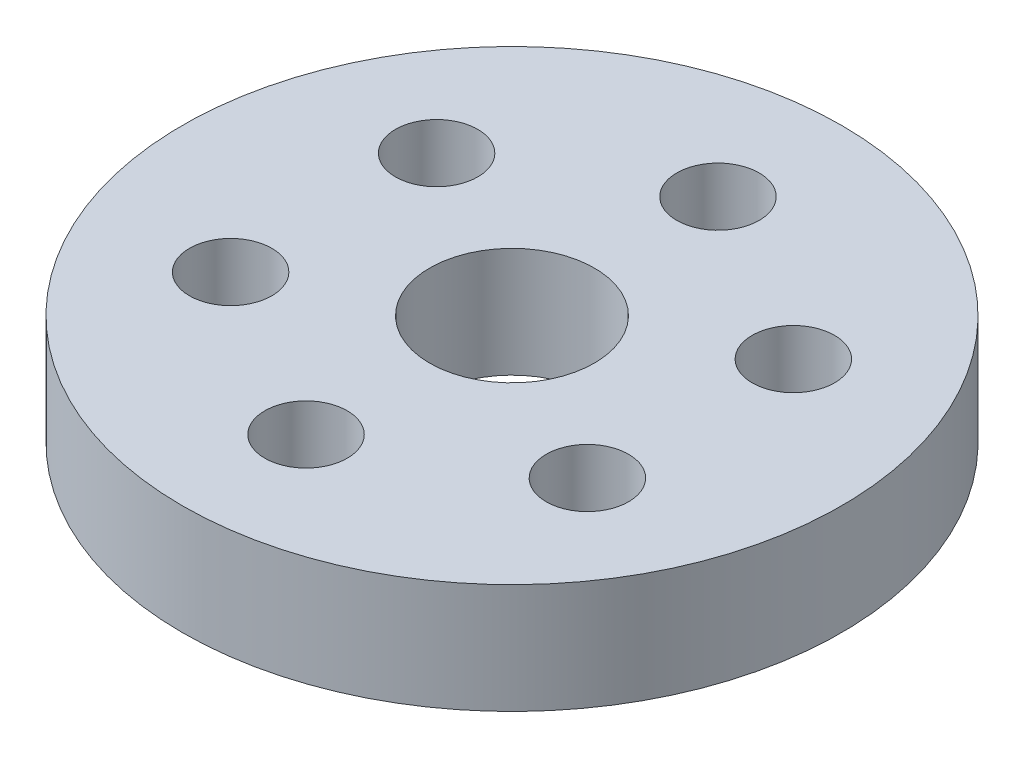
ISO-10303-21;
HEADER;
FILE_DESCRIPTION(('STEP AP214'),'2;1');
FILE_NAME('part.step','',(''),(''),'','','');
FILE_SCHEMA(('AUTOMOTIVE_DESIGN { 1 0 10303 214 1 1 1 1 }'));
ENDSEC;
DATA;
#1=APPLICATION_CONTEXT('core data for automotive mechanical design processes');
#2=APPLICATION_PROTOCOL_DEFINITION('international standard','automotive_design',2000,#1);
#3=PRODUCT_CONTEXT('',#1,'mechanical');
#4=PRODUCT('Part','Part','',(#3));
#5=PRODUCT_RELATED_PRODUCT_CATEGORY('part','',(#4));
#6=PRODUCT_DEFINITION_FORMATION('','',#4);
#7=PRODUCT_DEFINITION_CONTEXT('part definition',#1,'design');
#8=PRODUCT_DEFINITION('design','',#6,#7);
#9=PRODUCT_DEFINITION_SHAPE('','',#8);
#10=(LENGTH_UNIT() NAMED_UNIT(*) SI_UNIT(.MILLI.,.METRE.));
#11=(NAMED_UNIT(*) PLANE_ANGLE_UNIT() SI_UNIT($,.RADIAN.));
#12=(NAMED_UNIT(*) SI_UNIT($,.STERADIAN.) SOLID_ANGLE_UNIT());
#13=UNCERTAINTY_MEASURE_WITH_UNIT(LENGTH_MEASURE(1.E-05),#10,'distance_accuracy_value','');
#14=(GEOMETRIC_REPRESENTATION_CONTEXT(3) GLOBAL_UNCERTAINTY_ASSIGNED_CONTEXT((#13)) GLOBAL_UNIT_ASSIGNED_CONTEXT((#10,
#11,#12)) REPRESENTATION_CONTEXT('',''));
#15=CARTESIAN_POINT('',(0.,0.,0.));
#16=DIRECTION('',(0.,0.,1.));
#17=DIRECTION('',(1.,0.,0.));
#18=AXIS2_PLACEMENT_3D('',#15,#16,#17);
#19=CARTESIAN_POINT('',(0.,2.11666666666667,0.));
#20=DIRECTION('',(0.,1.,0.));
#21=DIRECTION('',(0.,0.,1.));
#22=AXIS2_PLACEMENT_3D('',#19,#20,#21);
#23=PLANE('',#22);
#24=CARTESIAN_POINT('',(-6.87407664253898,2.11666666666667,-3.96875));
#25=DIRECTION('',(0.,1.,0.));
#26=DIRECTION('',(0.,0.,1.));
#27=AXIS2_PLACEMENT_3D('',#24,#25,#26);
#28=CIRCLE('',#27,1.5875);
#29=CARTESIAN_POINT('',(-6.87407664253898,2.11666666666667,-2.38125));
#30=VERTEX_POINT('',#29);
#31=EDGE_CURVE('E82',#30,#30,#28,.T.);
#32=ORIENTED_EDGE('',*,*,#31,.F.);
#33=EDGE_LOOP('',(#32));
#34=FACE_BOUND('',#33,.T.);
#35=CARTESIAN_POINT('',(-6.87407664253898,2.11666666666667,3.96875));
#36=DIRECTION('',(0.,1.,0.));
#37=DIRECTION('',(0.,0.,1.));
#38=AXIS2_PLACEMENT_3D('',#35,#36,#37);
#39=CIRCLE('',#38,1.5875);
#40=CARTESIAN_POINT('',(-6.87407664253898,2.11666666666667,5.55625));
#41=VERTEX_POINT('',#40);
#42=EDGE_CURVE('E76',#41,#41,#39,.T.);
#43=ORIENTED_EDGE('',*,*,#42,.F.);
#44=EDGE_LOOP('',(#43));
#45=FACE_BOUND('',#44,.T.);
#46=CARTESIAN_POINT('',(0.,2.11666666666667,7.9375));
#47=DIRECTION('',(0.,1.,0.));
#48=DIRECTION('',(0.,0.,1.));
#49=AXIS2_PLACEMENT_3D('',#46,#47,#48);
#50=CIRCLE('',#49,1.5875);
#51=CARTESIAN_POINT('',(0.,2.11666666666667,9.525));
#52=VERTEX_POINT('',#51);
#53=EDGE_CURVE('E70',#52,#52,#50,.T.);
#54=ORIENTED_EDGE('',*,*,#53,.F.);
#55=EDGE_LOOP('',(#54));
#56=FACE_BOUND('',#55,.T.);
#57=CARTESIAN_POINT('',(6.87407664253898,2.11666666666667,3.96875));
#58=DIRECTION('',(0.,1.,0.));
#59=DIRECTION('',(0.,0.,1.));
#60=AXIS2_PLACEMENT_3D('',#57,#58,#59);
#61=CIRCLE('',#60,1.5875);
#62=CARTESIAN_POINT('',(6.87407664253898,2.11666666666667,5.55625));
#63=VERTEX_POINT('',#62);
#64=EDGE_CURVE('E64',#63,#63,#61,.T.);
#65=ORIENTED_EDGE('',*,*,#64,.F.);
#66=EDGE_LOOP('',(#65));
#67=FACE_BOUND('',#66,.T.);
#68=CARTESIAN_POINT('',(6.87407664253898,2.11666666666667,-3.96875));
#69=DIRECTION('',(0.,1.,0.));
#70=DIRECTION('',(0.,0.,1.));
#71=AXIS2_PLACEMENT_3D('',#68,#69,#70);
#72=CIRCLE('',#71,1.5875);
#73=CARTESIAN_POINT('',(6.87407664253898,2.11666666666667,-2.38125));
#74=VERTEX_POINT('',#73);
#75=EDGE_CURVE('E58',#74,#74,#72,.T.);
#76=ORIENTED_EDGE('',*,*,#75,.F.);
#77=EDGE_LOOP('',(#76));
#78=FACE_BOUND('',#77,.T.);
#79=CARTESIAN_POINT('',(0.,2.11666666666667,-7.9375));
#80=DIRECTION('',(0.,1.,0.));
#81=DIRECTION('',(0.,0.,1.));
#82=AXIS2_PLACEMENT_3D('',#79,#80,#81);
#83=CIRCLE('',#82,1.5875);
#84=CARTESIAN_POINT('',(0.,2.11666666666667,-6.35));
#85=VERTEX_POINT('',#84);
#86=EDGE_CURVE('E52',#85,#85,#83,.T.);
#87=ORIENTED_EDGE('',*,*,#86,.F.);
#88=EDGE_LOOP('',(#87));
#89=FACE_BOUND('',#88,.T.);
#90=CARTESIAN_POINT('',(0.,2.11666666666667,0.));
#91=DIRECTION('',(0.,1.,0.));
#92=DIRECTION('',(0.,0.,1.));
#93=AXIS2_PLACEMENT_3D('',#90,#91,#92);
#94=CIRCLE('',#93,12.7);
#95=CARTESIAN_POINT('',(0.,2.11666666666667,12.7));
#96=VERTEX_POINT('',#95);
#97=EDGE_CURVE('E10',#96,#96,#94,.T.);
#98=ORIENTED_EDGE('',*,*,#97,.T.);
#99=EDGE_LOOP('',(#98));
#100=FACE_BOUND('',#99,.T.);
#101=CARTESIAN_POINT('',(0.,2.11666666666667,0.));
#102=DIRECTION('',(0.,1.,0.));
#103=DIRECTION('',(0.,0.,1.));
#104=AXIS2_PLACEMENT_3D('',#101,#102,#103);
#105=CIRCLE('',#104,3.175);
#106=CARTESIAN_POINT('',(0.,2.11666666666667,3.175));
#107=VERTEX_POINT('',#106);
#108=EDGE_CURVE('E42',#107,#107,#105,.T.);
#109=ORIENTED_EDGE('',*,*,#108,.F.);
#110=EDGE_LOOP('',(#109));
#111=FACE_BOUND('',#110,.T.);
#112=ADVANCED_FACE('F31',(#34,#45,#56,#67,#78,#89,#100,#111),#23,.T.);
#113=CARTESIAN_POINT('',(0.,-2.11666666666667,0.));
#114=DIRECTION('',(0.,1.,0.));
#115=DIRECTION('',(0.,0.,1.));
#116=AXIS2_PLACEMENT_3D('',#113,#114,#115);
#117=PLANE('',#116);
#118=CARTESIAN_POINT('',(-6.87407664253898,-2.11666666666667,-3.96875));
#119=DIRECTION('',(0.,1.,0.));
#120=DIRECTION('',(0.,0.,1.));
#121=AXIS2_PLACEMENT_3D('',#118,#119,#120);
#122=CIRCLE('',#121,1.5875);
#123=CARTESIAN_POINT('',(-6.87407664253898,-2.11666666666667,-2.38125));
#124=VERTEX_POINT('',#123);
#125=EDGE_CURVE('E79',#124,#124,#122,.T.);
#126=ORIENTED_EDGE('',*,*,#125,.T.);
#127=EDGE_LOOP('',(#126));
#128=FACE_BOUND('',#127,.T.);
#129=CARTESIAN_POINT('',(-6.87407664253898,-2.11666666666667,3.96875));
#130=DIRECTION('',(0.,1.,0.));
#131=DIRECTION('',(0.,0.,1.));
#132=AXIS2_PLACEMENT_3D('',#129,#130,#131);
#133=CIRCLE('',#132,1.5875);
#134=CARTESIAN_POINT('',(-6.87407664253898,-2.11666666666667,5.55625));
#135=VERTEX_POINT('',#134);
#136=EDGE_CURVE('E73',#135,#135,#133,.T.);
#137=ORIENTED_EDGE('',*,*,#136,.T.);
#138=EDGE_LOOP('',(#137));
#139=FACE_BOUND('',#138,.T.);
#140=CARTESIAN_POINT('',(0.,-2.11666666666667,7.9375));
#141=DIRECTION('',(0.,1.,0.));
#142=DIRECTION('',(0.,0.,1.));
#143=AXIS2_PLACEMENT_3D('',#140,#141,#142);
#144=CIRCLE('',#143,1.5875);
#145=CARTESIAN_POINT('',(0.,-2.11666666666667,9.525));
#146=VERTEX_POINT('',#145);
#147=EDGE_CURVE('E67',#146,#146,#144,.T.);
#148=ORIENTED_EDGE('',*,*,#147,.T.);
#149=EDGE_LOOP('',(#148));
#150=FACE_BOUND('',#149,.T.);
#151=CARTESIAN_POINT('',(6.87407664253898,-2.11666666666667,3.96875));
#152=DIRECTION('',(0.,1.,0.));
#153=DIRECTION('',(0.,0.,1.));
#154=AXIS2_PLACEMENT_3D('',#151,#152,#153);
#155=CIRCLE('',#154,1.5875);
#156=CARTESIAN_POINT('',(6.87407664253898,-2.11666666666667,5.55625));
#157=VERTEX_POINT('',#156);
#158=EDGE_CURVE('E61',#157,#157,#155,.T.);
#159=ORIENTED_EDGE('',*,*,#158,.T.);
#160=EDGE_LOOP('',(#159));
#161=FACE_BOUND('',#160,.T.);
#162=CARTESIAN_POINT('',(6.87407664253898,-2.11666666666667,-3.96875));
#163=DIRECTION('',(0.,1.,0.));
#164=DIRECTION('',(0.,0.,1.));
#165=AXIS2_PLACEMENT_3D('',#162,#163,#164);
#166=CIRCLE('',#165,1.5875);
#167=CARTESIAN_POINT('',(6.87407664253898,-2.11666666666667,-2.38125));
#168=VERTEX_POINT('',#167);
#169=EDGE_CURVE('E55',#168,#168,#166,.T.);
#170=ORIENTED_EDGE('',*,*,#169,.T.);
#171=EDGE_LOOP('',(#170));
#172=FACE_BOUND('',#171,.T.);
#173=CARTESIAN_POINT('',(0.,-2.11666666666667,-7.9375));
#174=DIRECTION('',(0.,1.,0.));
#175=DIRECTION('',(0.,0.,1.));
#176=AXIS2_PLACEMENT_3D('',#173,#174,#175);
#177=CIRCLE('',#176,1.5875);
#178=CARTESIAN_POINT('',(0.,-2.11666666666667,-6.35));
#179=VERTEX_POINT('',#178);
#180=EDGE_CURVE('E47',#179,#179,#177,.T.);
#181=ORIENTED_EDGE('',*,*,#180,.T.);
#182=EDGE_LOOP('',(#181));
#183=FACE_BOUND('',#182,.T.);
#184=CARTESIAN_POINT('',(0.,-2.11666666666667,0.));
#185=DIRECTION('',(0.,1.,0.));
#186=DIRECTION('',(0.,0.,1.));
#187=AXIS2_PLACEMENT_3D('',#184,#185,#186);
#188=CIRCLE('',#187,12.7);
#189=CARTESIAN_POINT('',(0.,-2.11666666666667,12.7));
#190=VERTEX_POINT('',#189);
#191=EDGE_CURVE('E35',#190,#190,#188,.T.);
#192=ORIENTED_EDGE('',*,*,#191,.F.);
#193=EDGE_LOOP('',(#192));
#194=FACE_BOUND('',#193,.T.);
#195=CARTESIAN_POINT('',(0.,-2.11666666666667,0.));
#196=DIRECTION('',(0.,1.,0.));
#197=DIRECTION('',(0.,0.,1.));
#198=AXIS2_PLACEMENT_3D('',#195,#196,#197);
#199=CIRCLE('',#198,3.175);
#200=CARTESIAN_POINT('',(0.,-2.11666666666667,3.175));
#201=VERTEX_POINT('',#200);
#202=EDGE_CURVE('E44',#201,#201,#199,.T.);
#203=ORIENTED_EDGE('',*,*,#202,.T.);
#204=EDGE_LOOP('',(#203));
#205=FACE_BOUND('',#204,.T.);
#206=ADVANCED_FACE('F90',(#128,#139,#150,#161,#172,#183,#194,#205),#117,.F.);
#207=CARTESIAN_POINT('',(0.,2.11666666666667,0.));
#208=DIRECTION('',(0.,-1.,0.));
#209=DIRECTION('',(0.,0.,-1.));
#210=AXIS2_PLACEMENT_3D('',#207,#208,#209);
#211=CYLINDRICAL_SURFACE('',#210,12.7);
#212=ORIENTED_EDGE('',*,*,#97,.F.);
#213=EDGE_LOOP('',(#212));
#214=FACE_BOUND('',#213,.T.);
#215=ORIENTED_EDGE('',*,*,#191,.T.);
#216=EDGE_LOOP('',(#215));
#217=FACE_BOUND('',#216,.T.);
#218=ADVANCED_FACE('F33',(#214,#217),#211,.T.);
#219=CARTESIAN_POINT('',(0.,2.11666666666667,0.));
#220=DIRECTION('',(0.,-1.,0.));
#221=DIRECTION('',(0.,0.,-1.));
#222=AXIS2_PLACEMENT_3D('',#219,#220,#221);
#223=CYLINDRICAL_SURFACE('',#222,3.175);
#224=ORIENTED_EDGE('',*,*,#108,.T.);
#225=EDGE_LOOP('',(#224));
#226=FACE_BOUND('',#225,.T.);
#227=ORIENTED_EDGE('',*,*,#202,.F.);
#228=EDGE_LOOP('',(#227));
#229=FACE_BOUND('',#228,.T.);
#230=ADVANCED_FACE('F104',(#226,#229),#223,.F.);
#231=CARTESIAN_POINT('',(0.,-2.11666666666667,-7.9375));
#232=DIRECTION('',(0.,1.,0.));
#233=DIRECTION('',(0.,0.,1.));
#234=AXIS2_PLACEMENT_3D('',#231,#232,#233);
#235=CYLINDRICAL_SURFACE('',#234,1.5875);
#236=ORIENTED_EDGE('',*,*,#180,.F.);
#237=EDGE_LOOP('',(#236));
#238=FACE_BOUND('',#237,.T.);
#239=ORIENTED_EDGE('',*,*,#86,.T.);
#240=EDGE_LOOP('',(#239));
#241=FACE_BOUND('',#240,.T.);
#242=ADVANCED_FACE('F107',(#238,#241),#235,.F.);
#243=CARTESIAN_POINT('',(6.87407664253898,-2.11666666666667,-3.96875));
#244=DIRECTION('',(0.,1.,0.));
#245=DIRECTION('',(0.,0.,1.));
#246=AXIS2_PLACEMENT_3D('',#243,#244,#245);
#247=CYLINDRICAL_SURFACE('',#246,1.5875);
#248=ORIENTED_EDGE('',*,*,#169,.F.);
#249=EDGE_LOOP('',(#248));
#250=FACE_BOUND('',#249,.T.);
#251=ORIENTED_EDGE('',*,*,#75,.T.);
#252=EDGE_LOOP('',(#251));
#253=FACE_BOUND('',#252,.T.);
#254=ADVANCED_FACE('F121',(#250,#253),#247,.F.);
#255=CARTESIAN_POINT('',(6.87407664253898,-2.11666666666667,3.96875));
#256=DIRECTION('',(0.,1.,0.));
#257=DIRECTION('',(0.,0.,1.));
#258=AXIS2_PLACEMENT_3D('',#255,#256,#257);
#259=CYLINDRICAL_SURFACE('',#258,1.5875);
#260=ORIENTED_EDGE('',*,*,#158,.F.);
#261=EDGE_LOOP('',(#260));
#262=FACE_BOUND('',#261,.T.);
#263=ORIENTED_EDGE('',*,*,#64,.T.);
#264=EDGE_LOOP('',(#263));
#265=FACE_BOUND('',#264,.T.);
#266=ADVANCED_FACE('F125',(#262,#265),#259,.F.);
#267=CARTESIAN_POINT('',(0.,-2.11666666666667,7.9375));
#268=DIRECTION('',(0.,1.,0.));
#269=DIRECTION('',(0.,0.,1.));
#270=AXIS2_PLACEMENT_3D('',#267,#268,#269);
#271=CYLINDRICAL_SURFACE('',#270,1.5875);
#272=ORIENTED_EDGE('',*,*,#147,.F.);
#273=EDGE_LOOP('',(#272));
#274=FACE_BOUND('',#273,.T.);
#275=ORIENTED_EDGE('',*,*,#53,.T.);
#276=EDGE_LOOP('',(#275));
#277=FACE_BOUND('',#276,.T.);
#278=ADVANCED_FACE('F129',(#274,#277),#271,.F.);
#279=CARTESIAN_POINT('',(-6.87407664253898,-2.11666666666667,3.96875));
#280=DIRECTION('',(0.,1.,0.));
#281=DIRECTION('',(0.,0.,1.));
#282=AXIS2_PLACEMENT_3D('',#279,#280,#281);
#283=CYLINDRICAL_SURFACE('',#282,1.5875);
#284=ORIENTED_EDGE('',*,*,#136,.F.);
#285=EDGE_LOOP('',(#284));
#286=FACE_BOUND('',#285,.T.);
#287=ORIENTED_EDGE('',*,*,#42,.T.);
#288=EDGE_LOOP('',(#287));
#289=FACE_BOUND('',#288,.T.);
#290=ADVANCED_FACE('F133',(#286,#289),#283,.F.);
#291=CARTESIAN_POINT('',(-6.87407664253898,-2.11666666666667,-3.96875));
#292=DIRECTION('',(0.,1.,0.));
#293=DIRECTION('',(0.,0.,1.));
#294=AXIS2_PLACEMENT_3D('',#291,#292,#293);
#295=CYLINDRICAL_SURFACE('',#294,1.5875);
#296=ORIENTED_EDGE('',*,*,#125,.F.);
#297=EDGE_LOOP('',(#296));
#298=FACE_BOUND('',#297,.T.);
#299=ORIENTED_EDGE('',*,*,#31,.T.);
#300=EDGE_LOOP('',(#299));
#301=FACE_BOUND('',#300,.T.);
#302=ADVANCED_FACE('F86',(#298,#301),#295,.F.);
#303=CLOSED_SHELL('',(#112,#206,#218,#230,#242,#254,#266,#278,#290,#302));
#304=MANIFOLD_SOLID_BREP('B2',#303);
#305=ADVANCED_BREP_SHAPE_REPRESENTATION('',(#18,#304),#14);
#306=SHAPE_DEFINITION_REPRESENTATION(#9,#305);
ENDSEC;
END-ISO-10303-21;
